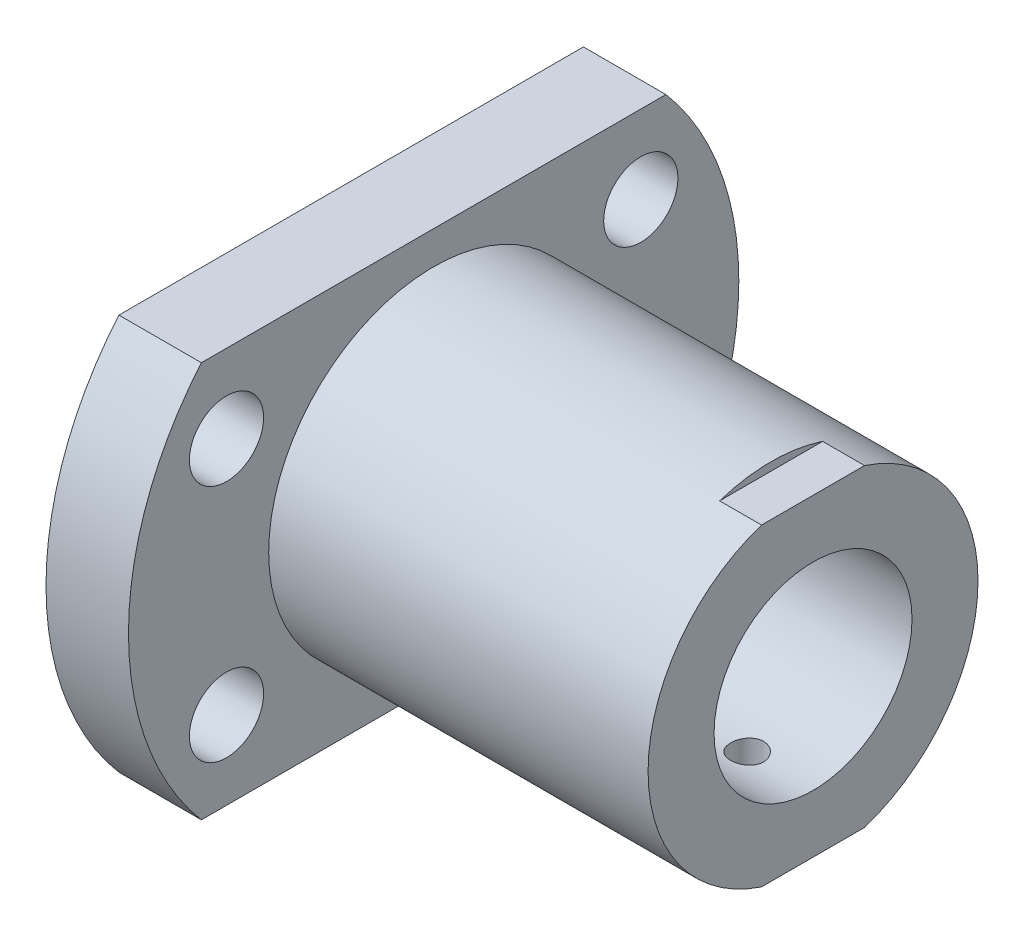
ISO-10303-21;
HEADER;
FILE_DESCRIPTION(('STEP AP214'),'2;1');
FILE_NAME('part.step','',(''),(''),'','','');
FILE_SCHEMA(('AUTOMOTIVE_DESIGN { 1 0 10303 214 1 1 1 1 }'));
ENDSEC;
DATA;
#1=APPLICATION_CONTEXT('core data for automotive mechanical design processes');
#2=APPLICATION_PROTOCOL_DEFINITION('international standard','automotive_design',2000,#1);
#3=PRODUCT_CONTEXT('',#1,'mechanical');
#4=PRODUCT('Part','Part','',(#3));
#5=PRODUCT_RELATED_PRODUCT_CATEGORY('part','',(#4));
#6=PRODUCT_DEFINITION_FORMATION('','',#4);
#7=PRODUCT_DEFINITION_CONTEXT('part definition',#1,'design');
#8=PRODUCT_DEFINITION('design','',#6,#7);
#9=PRODUCT_DEFINITION_SHAPE('','',#8);
#10=(LENGTH_UNIT() NAMED_UNIT(*) SI_UNIT(.MILLI.,.METRE.));
#11=(NAMED_UNIT(*) PLANE_ANGLE_UNIT() SI_UNIT($,.RADIAN.));
#12=(NAMED_UNIT(*) SI_UNIT($,.STERADIAN.) SOLID_ANGLE_UNIT());
#13=UNCERTAINTY_MEASURE_WITH_UNIT(LENGTH_MEASURE(1.E-05),#10,'distance_accuracy_value','');
#14=(GEOMETRIC_REPRESENTATION_CONTEXT(3) GLOBAL_UNCERTAINTY_ASSIGNED_CONTEXT((#13)) GLOBAL_UNIT_ASSIGNED_CONTEXT((#10,
#11,#12)) REPRESENTATION_CONTEXT('',''));
#15=CARTESIAN_POINT('',(0.,0.,0.));
#16=DIRECTION('',(0.,0.,1.));
#17=DIRECTION('',(1.,0.,0.));
#18=AXIS2_PLACEMENT_3D('',#15,#16,#17);
#19=CARTESIAN_POINT('',(0.,0.,0.));
#20=DIRECTION('',(1.,0.,0.));
#21=DIRECTION('',(0.,0.,-0.999999999999998));
#22=AXIS2_PLACEMENT_3D('',#19,#20,#21);
#23=PLANE('',#22);
#24=DIRECTION('',(0.,0.,-0.999999999999998));
#25=VECTOR('',#24,1.);
#26=CARTESIAN_POINT('',(0.,-12.,-14.0801278403287));
#27=LINE('',#26,#25);
#28=CARTESIAN_POINT('',(0.,-12.,14.0801278403287));
#29=VERTEX_POINT('',#28);
#30=CARTESIAN_POINT('',(0.,-12.,-14.0801278403287));
#31=VERTEX_POINT('',#30);
#32=EDGE_CURVE('E98',#29,#31,#27,.T.);
#33=ORIENTED_EDGE('',*,*,#32,.F.);
#34=CARTESIAN_POINT('',(0.,0.,0.));
#35=DIRECTION('',(-1.,0.,0.));
#36=DIRECTION('',(0.,0.,0.999999999999998));
#37=AXIS2_PLACEMENT_3D('',#34,#35,#36);
#38=CIRCLE('',#37,18.5);
#39=CARTESIAN_POINT('',(0.,12.,14.0801278403287));
#40=VERTEX_POINT('',#39);
#41=EDGE_CURVE('E85',#40,#29,#38,.F.);
#42=ORIENTED_EDGE('',*,*,#41,.F.);
#43=DIRECTION('',(0.,0.,0.999999999999998));
#44=VECTOR('',#43,1.);
#45=CARTESIAN_POINT('',(0.,12.,-14.0801278403287));
#46=LINE('',#45,#44);
#47=CARTESIAN_POINT('',(0.,12.,-14.0801278403287));
#48=VERTEX_POINT('',#47);
#49=EDGE_CURVE('E95',#48,#40,#46,.T.);
#50=ORIENTED_EDGE('',*,*,#49,.F.);
#51=CARTESIAN_POINT('',(0.,0.,0.));
#52=DIRECTION('',(-1.,0.,0.));
#53=DIRECTION('',(0.,0.,0.999999999999998));
#54=AXIS2_PLACEMENT_3D('',#51,#52,#53);
#55=CIRCLE('',#54,18.5);
#56=EDGE_CURVE('E101',#31,#48,#55,.F.);
#57=ORIENTED_EDGE('',*,*,#56,.F.);
#58=EDGE_LOOP('',(#33,#42,#50,#57));
#59=FACE_BOUND('',#58,.T.);
#60=CARTESIAN_POINT('',(0.,0.,0.));
#61=DIRECTION('',(-1.,0.,0.));
#62=DIRECTION('',(0.,0.,0.999999999999998));
#63=AXIS2_PLACEMENT_3D('',#60,#61,#62);
#64=CIRCLE('',#63,6.);
#65=CARTESIAN_POINT('',(0.,0.,5.99999999999999));
#66=VERTEX_POINT('',#65);
#67=EDGE_CURVE('E177',#66,#66,#64,.F.);
#68=ORIENTED_EDGE('',*,*,#67,.T.);
#69=EDGE_LOOP('',(#68));
#70=FACE_BOUND('',#69,.T.);
#71=CARTESIAN_POINT('',(0.,7.25,-12.5573683548743));
#72=DIRECTION('',(-1.,0.,0.));
#73=DIRECTION('',(0.,0.,0.999999999999998));
#74=AXIS2_PLACEMENT_3D('',#71,#72,#73);
#75=CIRCLE('',#74,2.25);
#76=CARTESIAN_POINT('',(0.,7.25,-10.3073683548743));
#77=VERTEX_POINT('',#76);
#78=EDGE_CURVE('E104',#77,#77,#75,.F.);
#79=ORIENTED_EDGE('',*,*,#78,.T.);
#80=EDGE_LOOP('',(#79));
#81=FACE_BOUND('',#80,.T.);
#82=CARTESIAN_POINT('',(0.,-7.25,-12.5573683548743));
#83=DIRECTION('',(-1.,0.,0.));
#84=DIRECTION('',(0.,0.,0.999999999999998));
#85=AXIS2_PLACEMENT_3D('',#82,#83,#84);
#86=CIRCLE('',#85,2.25);
#87=CARTESIAN_POINT('',(0.,-7.25,-10.3073683548743));
#88=VERTEX_POINT('',#87);
#89=EDGE_CURVE('E184',#88,#88,#86,.F.);
#90=ORIENTED_EDGE('',*,*,#89,.T.);
#91=EDGE_LOOP('',(#90));
#92=FACE_BOUND('',#91,.T.);
#93=CARTESIAN_POINT('',(0.,-7.25000000000001,12.5573683548743));
#94=DIRECTION('',(-1.,0.,0.));
#95=DIRECTION('',(0.,0.,0.999999999999998));
#96=AXIS2_PLACEMENT_3D('',#93,#94,#95);
#97=CIRCLE('',#96,2.25);
#98=CARTESIAN_POINT('',(0.,-7.25000000000001,14.8073683548743));
#99=VERTEX_POINT('',#98);
#100=EDGE_CURVE('E186',#99,#99,#97,.F.);
#101=ORIENTED_EDGE('',*,*,#100,.T.);
#102=EDGE_LOOP('',(#101));
#103=FACE_BOUND('',#102,.T.);
#104=CARTESIAN_POINT('',(0.,7.25000000000001,12.5573683548743));
#105=DIRECTION('',(-1.,0.,0.));
#106=DIRECTION('',(0.,0.,0.999999999999998));
#107=AXIS2_PLACEMENT_3D('',#104,#105,#106);
#108=CIRCLE('',#107,2.25);
#109=CARTESIAN_POINT('',(0.,7.25000000000001,14.8073683548743));
#110=VERTEX_POINT('',#109);
#111=EDGE_CURVE('E27',#110,#110,#108,.F.);
#112=ORIENTED_EDGE('',*,*,#111,.T.);
#113=EDGE_LOOP('',(#112));
#114=FACE_BOUND('',#113,.T.);
#115=ADVANCED_FACE('F24',(#59,#70,#81,#92,#103,#114),#23,.F.);
#116=CARTESIAN_POINT('',(28.,7.25000000000001,12.5573683548743));
#117=DIRECTION('',(-1.,0.,0.));
#118=DIRECTION('',(0.,0.,0.999999999999998));
#119=AXIS2_PLACEMENT_3D('',#116,#117,#118);
#120=CYLINDRICAL_SURFACE('',#119,2.25);
#121=CARTESIAN_POINT('',(5.00000000000012,7.25,12.5573683548744));
#122=DIRECTION('',(-1.,0.,0.));
#123=DIRECTION('',(0.,0.,0.999999999999998));
#124=AXIS2_PLACEMENT_3D('',#121,#122,#123);
#125=CIRCLE('',#124,2.25);
#126=CARTESIAN_POINT('',(5.00000000000012,7.25,14.8073683548744));
#127=VERTEX_POINT('',#126);
#128=EDGE_CURVE('E412',#127,#127,#125,.F.);
#129=ORIENTED_EDGE('',*,*,#128,.T.);
#130=EDGE_LOOP('',(#129));
#131=FACE_BOUND('',#130,.T.);
#132=ORIENTED_EDGE('',*,*,#111,.F.);
#133=EDGE_LOOP('',(#132));
#134=FACE_BOUND('',#133,.T.);
#135=ADVANCED_FACE('F194',(#131,#134),#120,.F.);
#136=CARTESIAN_POINT('',(28.,-7.25000000000001,12.5573683548743));
#137=DIRECTION('',(-1.,0.,0.));
#138=DIRECTION('',(0.,0.,0.999999999999998));
#139=AXIS2_PLACEMENT_3D('',#136,#137,#138);
#140=CYLINDRICAL_SURFACE('',#139,2.25);
#141=CARTESIAN_POINT('',(5.00000000000012,-7.25000000000001,12.5573683548743));
#142=DIRECTION('',(-1.,0.,0.));
#143=DIRECTION('',(0.,0.,0.999999999999998));
#144=AXIS2_PLACEMENT_3D('',#141,#142,#143);
#145=CIRCLE('',#144,2.25);
#146=CARTESIAN_POINT('',(5.00000000000012,-7.25000000000001,14.8073683548743));
#147=VERTEX_POINT('',#146);
#148=EDGE_CURVE('E408',#147,#147,#145,.F.);
#149=ORIENTED_EDGE('',*,*,#148,.T.);
#150=EDGE_LOOP('',(#149));
#151=FACE_BOUND('',#150,.T.);
#152=ORIENTED_EDGE('',*,*,#100,.F.);
#153=EDGE_LOOP('',(#152));
#154=FACE_BOUND('',#153,.T.);
#155=ADVANCED_FACE('F196',(#151,#154),#140,.F.);
#156=CARTESIAN_POINT('',(28.,-7.25,-12.5573683548743));
#157=DIRECTION('',(-1.,0.,0.));
#158=DIRECTION('',(0.,0.,0.999999999999998));
#159=AXIS2_PLACEMENT_3D('',#156,#157,#158);
#160=CYLINDRICAL_SURFACE('',#159,2.25);
#161=CARTESIAN_POINT('',(4.99999999999989,-7.25,-12.5573683548743));
#162=DIRECTION('',(-1.,0.,0.));
#163=DIRECTION('',(0.,0.,0.999999999999998));
#164=AXIS2_PLACEMENT_3D('',#161,#162,#163);
#165=CIRCLE('',#164,2.25);
#166=CARTESIAN_POINT('',(4.99999999999989,-7.25,-10.3073683548743));
#167=VERTEX_POINT('',#166);
#168=EDGE_CURVE('E266',#167,#167,#165,.F.);
#169=ORIENTED_EDGE('',*,*,#168,.T.);
#170=EDGE_LOOP('',(#169));
#171=FACE_BOUND('',#170,.T.);
#172=ORIENTED_EDGE('',*,*,#89,.F.);
#173=EDGE_LOOP('',(#172));
#174=FACE_BOUND('',#173,.T.);
#175=ADVANCED_FACE('F204',(#171,#174),#160,.F.);
#176=CARTESIAN_POINT('',(28.,7.25,-12.5573683548743));
#177=DIRECTION('',(-1.,0.,0.));
#178=DIRECTION('',(0.,0.,0.999999999999998));
#179=AXIS2_PLACEMENT_3D('',#176,#177,#178);
#180=CYLINDRICAL_SURFACE('',#179,2.25);
#181=CARTESIAN_POINT('',(4.99999999999989,7.24999999999999,-12.5573683548743));
#182=DIRECTION('',(-1.,0.,0.));
#183=DIRECTION('',(0.,0.,0.999999999999998));
#184=AXIS2_PLACEMENT_3D('',#181,#182,#183);
#185=CIRCLE('',#184,2.25);
#186=CARTESIAN_POINT('',(4.99999999999989,7.24999999999999,-10.3073683548743));
#187=VERTEX_POINT('',#186);
#188=EDGE_CURVE('E263',#187,#187,#185,.F.);
#189=ORIENTED_EDGE('',*,*,#188,.T.);
#190=EDGE_LOOP('',(#189));
#191=FACE_BOUND('',#190,.T.);
#192=ORIENTED_EDGE('',*,*,#78,.F.);
#193=EDGE_LOOP('',(#192));
#194=FACE_BOUND('',#193,.T.);
#195=ADVANCED_FACE('F212',(#191,#194),#180,.F.);
#196=CARTESIAN_POINT('',(4.99999999999989,-12.,-14.0801278403287));
#197=DIRECTION('',(0.,-0.999999999999998,0.));
#198=DIRECTION('',(0.,0.,-0.999999999999998));
#199=AXIS2_PLACEMENT_3D('',#196,#197,#198);
#200=PLANE('',#199);
#201=DIRECTION('',(0.,0.,0.999999999999998));
#202=VECTOR('',#201,1.);
#203=CARTESIAN_POINT('',(5.00000000000012,-12.,0.));
#204=LINE('',#203,#202);
#205=CARTESIAN_POINT('',(4.99999999999989,-12.,-14.0801278403287));
#206=VERTEX_POINT('',#205);
#207=CARTESIAN_POINT('',(5.00000000000012,-12.,14.0801278403287));
#208=VERTEX_POINT('',#207);
#209=EDGE_CURVE('E109',#206,#208,#204,.T.);
#210=ORIENTED_EDGE('',*,*,#209,.T.);
#211=DIRECTION('',(-1.,0.,0.));
#212=VECTOR('',#211,1.);
#213=CARTESIAN_POINT('',(5.00000000000012,-12.,14.0801278403287));
#214=LINE('',#213,#212);
#215=EDGE_CURVE('E91',#29,#208,#214,.F.);
#216=ORIENTED_EDGE('',*,*,#215,.F.);
#217=ORIENTED_EDGE('',*,*,#32,.T.);
#218=DIRECTION('',(-1.,0.,0.));
#219=VECTOR('',#218,1.);
#220=CARTESIAN_POINT('',(4.99999999999989,-12.,-14.0801278403287));
#221=LINE('',#220,#219);
#222=EDGE_CURVE('E256',#206,#31,#221,.T.);
#223=ORIENTED_EDGE('',*,*,#222,.F.);
#224=EDGE_LOOP('',(#210,#216,#217,#223));
#225=FACE_BOUND('',#224,.T.);
#226=ADVANCED_FACE('F107',(#225),#200,.T.);
#227=CARTESIAN_POINT('',(5.00000000000012,0.,0.));
#228=DIRECTION('',(-1.,0.,0.));
#229=DIRECTION('',(0.,0.,0.999999999999998));
#230=AXIS2_PLACEMENT_3D('',#227,#228,#229);
#231=CYLINDRICAL_SURFACE('',#230,18.5);
#232=DIRECTION('',(1.,0.,0.));
#233=VECTOR('',#232,1.);
#234=CARTESIAN_POINT('',(5.00000000000012,12.,14.0801278403287));
#235=LINE('',#234,#233);
#236=CARTESIAN_POINT('',(5.00000000000012,12.,14.0801278403287));
#237=VERTEX_POINT('',#236);
#238=EDGE_CURVE('E93',#40,#237,#235,.T.);
#239=ORIENTED_EDGE('',*,*,#238,.F.);
#240=ORIENTED_EDGE('',*,*,#41,.T.);
#241=ORIENTED_EDGE('',*,*,#215,.T.);
#242=CARTESIAN_POINT('',(5.00000000000012,0.,0.));
#243=DIRECTION('',(-1.,0.,0.));
#244=DIRECTION('',(0.,0.,0.999999999999998));
#245=AXIS2_PLACEMENT_3D('',#242,#243,#244);
#246=CIRCLE('',#245,18.5);
#247=EDGE_CURVE('E262',#208,#237,#246,.T.);
#248=ORIENTED_EDGE('',*,*,#247,.T.);
#249=EDGE_LOOP('',(#239,#240,#241,#248));
#250=FACE_BOUND('',#249,.T.);
#251=ADVANCED_FACE('F89',(#250),#231,.T.);
#252=CARTESIAN_POINT('',(4.99999999999989,12.,-14.0801278403287));
#253=DIRECTION('',(0.,0.999999999999998,0.));
#254=DIRECTION('',(0.,0.,0.999999999999998));
#255=AXIS2_PLACEMENT_3D('',#252,#253,#254);
#256=PLANE('',#255);
#257=DIRECTION('',(0.,0.,0.999999999999998));
#258=VECTOR('',#257,1.);
#259=CARTESIAN_POINT('',(5.00000000000012,12.,0.));
#260=LINE('',#259,#258);
#261=CARTESIAN_POINT('',(4.99999999999989,12.,-14.0801278403287));
#262=VERTEX_POINT('',#261);
#263=EDGE_CURVE('E251',#237,#262,#260,.F.);
#264=ORIENTED_EDGE('',*,*,#263,.T.);
#265=DIRECTION('',(-1.,0.,0.));
#266=VECTOR('',#265,1.);
#267=CARTESIAN_POINT('',(4.99999999999989,12.,-14.0801278403287));
#268=LINE('',#267,#266);
#269=EDGE_CURVE('E180',#48,#262,#268,.F.);
#270=ORIENTED_EDGE('',*,*,#269,.F.);
#271=ORIENTED_EDGE('',*,*,#49,.T.);
#272=ORIENTED_EDGE('',*,*,#238,.T.);
#273=EDGE_LOOP('',(#264,#270,#271,#272));
#274=FACE_BOUND('',#273,.T.);
#275=ADVANCED_FACE('F221',(#274),#256,.T.);
#276=CARTESIAN_POINT('',(5.00000000000012,0.,0.));
#277=DIRECTION('',(-1.,0.,0.));
#278=DIRECTION('',(0.,0.,0.999999999999998));
#279=AXIS2_PLACEMENT_3D('',#276,#277,#278);
#280=CYLINDRICAL_SURFACE('',#279,18.5);
#281=CARTESIAN_POINT('',(5.00000000000012,0.,0.));
#282=DIRECTION('',(-1.,0.,0.));
#283=DIRECTION('',(0.,0.,0.999999999999998));
#284=AXIS2_PLACEMENT_3D('',#281,#282,#283);
#285=CIRCLE('',#284,18.5);
#286=EDGE_CURVE('E248',#262,#206,#285,.T.);
#287=ORIENTED_EDGE('',*,*,#286,.T.);
#288=ORIENTED_EDGE('',*,*,#222,.T.);
#289=ORIENTED_EDGE('',*,*,#56,.T.);
#290=ORIENTED_EDGE('',*,*,#269,.T.);
#291=EDGE_LOOP('',(#287,#288,#289,#290));
#292=FACE_BOUND('',#291,.T.);
#293=ADVANCED_FACE('F224',(#292),#280,.T.);
#294=CARTESIAN_POINT('',(25.46,-9.49999999999995,-18.4999999999999));
#295=DIRECTION('',(-1.,0.,0.));
#296=DIRECTION('',(0.,-0.999999999999998,0.));
#297=AXIS2_PLACEMENT_3D('',#294,#295,#296);
#298=PLANE('',#297);
#299=CARTESIAN_POINT('',(25.46,0.,0.));
#300=DIRECTION('',(-1.,0.,0.));
#301=DIRECTION('',(0.,0.,0.999999999999998));
#302=AXIS2_PLACEMENT_3D('',#299,#300,#301);
#303=CIRCLE('',#302,10.);
#304=CARTESIAN_POINT('',(25.46,-9.49999999999995,-3.12249899919919));
#305=VERTEX_POINT('',#304);
#306=CARTESIAN_POINT('',(25.46,-9.49999999999995,3.1224989991992));
#307=VERTEX_POINT('',#306);
#308=EDGE_CURVE('E139',#305,#307,#303,.T.);
#309=ORIENTED_EDGE('',*,*,#308,.F.);
#310=DIRECTION('',(0.,0.,0.999999999999998));
#311=VECTOR('',#310,1.);
#312=CARTESIAN_POINT('',(25.46,-9.49999999999995,-18.4999999999999));
#313=LINE('',#312,#311);
#314=EDGE_CURVE('E178',#305,#307,#313,.T.);
#315=ORIENTED_EDGE('',*,*,#314,.T.);
#316=EDGE_LOOP('',(#309,#315));
#317=FACE_BOUND('',#316,.T.);
#318=ADVANCED_FACE('F227',(#317),#298,.F.);
#319=CARTESIAN_POINT('',(24.,-12.,0.));
#320=DIRECTION('',(0.,0.999999999999998,0.));
#321=DIRECTION('',(0.,0.,0.999999999999998));
#322=AXIS2_PLACEMENT_3D('',#319,#320,#321);
#323=CYLINDRICAL_SURFACE('',#322,0.999999999999998);
#324=CARTESIAN_POINT('',(24.,-5.9160797830996,0.999999999999998));
#325=CARTESIAN_POINT('',(24.0556957397448,-5.91608089760081,0.999997430362741));
#326=CARTESIAN_POINT('',(24.1114625857719,-5.91687549623226,0.995327225125161));
#327=CARTESIAN_POINT('',(24.221473367225,-5.91996725428782,0.976766506224323));
#328=CARTESIAN_POINT('',(24.2757139738487,-5.92226746704963,0.962857255219484));
#329=CARTESIAN_POINT('',(24.3810020750205,-5.9281028210368,0.926249422813524));
#330=CARTESIAN_POINT('',(24.4320535063324,-5.93163640278116,0.903561936766058));
#331=CARTESIAN_POINT('',(24.5296048620221,-5.93953821561519,0.850066639095283));
#332=CARTESIAN_POINT('',(24.5761064650154,-5.94390613711394,0.819261837886826));
#333=CARTESIAN_POINT('',(24.6637238714249,-5.95303376602086,0.750075912978837));
#334=CARTESIAN_POINT('',(24.7047878920607,-5.95779662271406,0.711629612614978));
#335=CARTESIAN_POINT('',(24.7799155928021,-5.96714968490889,0.628391119356976));
#336=CARTESIAN_POINT('',(24.8139784963782,-5.97173987121269,0.583598223459339));
#337=CARTESIAN_POINT('',(24.8743259504081,-5.98026296666788,0.488608939901644));
#338=CARTESIAN_POINT('',(24.9005630285583,-5.98419180380442,0.438381996060007));
#339=CARTESIAN_POINT('',(24.9442085816065,-5.99091497211554,0.334157780528439));
#340=CARTESIAN_POINT('',(24.9616177068691,-5.99370938686121,0.280160786915636));
#341=CARTESIAN_POINT('',(24.9869570028592,-5.99782693717047,0.17045753626894));
#342=CARTESIAN_POINT('',(24.9949731532148,-5.99916341023759,0.114771647626942));
#343=CARTESIAN_POINT('',(25.0015663038604,-6.00026031774893,0.00283020778882557));
#344=CARTESIAN_POINT('',(25.0001439300671,-6.00002085670141,-0.0534253053855496));
#345=CARTESIAN_POINT('',(24.9879674852323,-5.99800343784228,-0.164320648453429));
#346=CARTESIAN_POINT('',(24.9773060259492,-5.99624074921798,-0.218970964751025));
#347=CARTESIAN_POINT('',(24.9470997266195,-5.99139194038926,-0.325696364455009));
#348=CARTESIAN_POINT('',(24.9275545434525,-5.98830576906757,-0.377771348306917));
#349=CARTESIAN_POINT('',(24.8800428392955,-5.9811306549925,-0.478144400660144));
#350=CARTESIAN_POINT('',(24.8520378864421,-5.97703715210987,-0.526423938030269));
#351=CARTESIAN_POINT('',(24.7884320570964,-5.96830259348044,-0.617629541642183));
#352=CARTESIAN_POINT('',(24.7528311514854,-5.96366153563462,-0.660555587360568));
#353=CARTESIAN_POINT('',(24.6745373682106,-5.95428211061504,-0.740379653882549));
#354=CARTESIAN_POINT('',(24.6317648343995,-5.94954324332981,-0.777199520036914));
#355=CARTESIAN_POINT('',(24.5405857257886,-5.9405537217856,-0.843169007131577));
#356=CARTESIAN_POINT('',(24.4921766297696,-5.9363032877035,-0.872315176491826));
#357=CARTESIAN_POINT('',(24.3909947392698,-5.92877116046281,-0.922122995219518));
#358=CARTESIAN_POINT('',(24.3382137479272,-5.92549134225202,-0.942768253004008));
#359=CARTESIAN_POINT('',(24.2299355600205,-5.92030089070035,-0.974836086298908));
#360=CARTESIAN_POINT('',(24.1744443666017,-5.91838736593833,-0.986278144632032));
#361=CARTESIAN_POINT('',(24.0987926780436,-5.91687159118962,-0.995305748985427));
#362=CARTESIAN_POINT('',(24.0790789007516,-5.91657531838754,-0.997064672925258));
#363=CARTESIAN_POINT('',(24.0395797428413,-5.91617921619692,-0.999412255641836));
#364=CARTESIAN_POINT('',(24.0197943621517,-5.91607938700396,-1.00000091325352));
#365=CARTESIAN_POINT('',(23.9443042602552,-5.91608089760082,-0.999997430362724));
#366=CARTESIAN_POINT('',(23.888537414228,-5.91687549623227,-0.995327225125135));
#367=CARTESIAN_POINT('',(23.7785266327749,-5.91996725428782,-0.976766506224316));
#368=CARTESIAN_POINT('',(23.7242860261512,-5.92226746704962,-0.962857255219505));
#369=CARTESIAN_POINT('',(23.6189979249794,-5.9281028210368,-0.926249422813522));
#370=CARTESIAN_POINT('',(23.5679464936675,-5.93163640278117,-0.903561936766016));
#371=CARTESIAN_POINT('',(23.4703951379778,-5.93953821561521,-0.85006663909523));
#372=CARTESIAN_POINT('',(23.4238935349846,-5.94390613711396,-0.819261837886801));
#373=CARTESIAN_POINT('',(23.3362761285751,-5.95303376602087,-0.750075912978841));
#374=CARTESIAN_POINT('',(23.2952121079394,-5.95779662271406,-0.71162961261498));
#375=CARTESIAN_POINT('',(23.220084407198,-5.96714968490889,-0.628391119356981));
#376=CARTESIAN_POINT('',(23.1860215036219,-5.9717398712127,-0.583598223459348));
#377=CARTESIAN_POINT('',(23.125674049592,-5.98026296666789,-0.48860893990163));
#378=CARTESIAN_POINT('',(23.0994369714418,-5.98419180380442,-0.438381996059965));
#379=CARTESIAN_POINT('',(23.0557914183935,-5.99091497211554,-0.334157780528404));
#380=CARTESIAN_POINT('',(23.0383822931307,-5.99370938686122,-0.280160786915637));
#381=CARTESIAN_POINT('',(23.0130429971406,-5.99782693717048,-0.170457536268957));
#382=CARTESIAN_POINT('',(23.0050268467852,-5.99916341023759,-0.114771647626942));
#383=CARTESIAN_POINT('',(22.9984336961397,-6.00026031774893,-0.00283020778881479));
#384=CARTESIAN_POINT('',(22.999856069933,-6.00002085670142,0.053425305385553));
#385=CARTESIAN_POINT('',(23.0120325147677,-5.99800343784229,0.16432064845343));
#386=CARTESIAN_POINT('',(23.0226939740508,-5.99624074921798,0.218970964751031));
#387=CARTESIAN_POINT('',(23.0529002733805,-5.99139194038926,0.325696364455016));
#388=CARTESIAN_POINT('',(23.0724454565476,-5.98830576906757,0.377771348306921));
#389=CARTESIAN_POINT('',(23.1199571607045,-5.9811306549925,0.478144400660142));
#390=CARTESIAN_POINT('',(23.147962113558,-5.97703715210987,0.526423938030264));
#391=CARTESIAN_POINT('',(23.2115679429037,-5.96830259348044,0.617629541642179));
#392=CARTESIAN_POINT('',(23.2471688485147,-5.96366153563462,0.660555587360567));
#393=CARTESIAN_POINT('',(23.3254626317895,-5.95428211061504,0.74037965388255));
#394=CARTESIAN_POINT('',(23.3682351656005,-5.9495432433298,0.777199520036914));
#395=CARTESIAN_POINT('',(23.4594142742115,-5.9405537217856,0.843169007131579));
#396=CARTESIAN_POINT('',(23.5078233702305,-5.93630328770352,0.872315176491831));
#397=CARTESIAN_POINT('',(23.6090052607303,-5.92877116046282,0.92212299521952));
#398=CARTESIAN_POINT('',(23.6617862520729,-5.92549134225202,0.942768253004003));
#399=CARTESIAN_POINT('',(23.7700644399796,-5.92030089070036,0.974836086298911));
#400=CARTESIAN_POINT('',(23.8255556333984,-5.91838736593835,0.986278144632048));
#401=CARTESIAN_POINT('',(23.9012073219564,-5.91687159118963,0.995305748985431));
#402=CARTESIAN_POINT('',(23.9209210992484,-5.91657531838754,0.997064672925256));
#403=CARTESIAN_POINT('',(23.9604202571587,-5.91617921619692,0.999412255641834));
#404=CARTESIAN_POINT('',(23.9802056378483,-5.91607938700395,1.00000091325352));
#405=CARTESIAN_POINT('',(24.,-5.9160797830996,0.999999999999998));
#406=B_SPLINE_CURVE_WITH_KNOTS('',3,(#324,#325,#326,#327,#328,#329,#330,#331,#332,#333,#334,
#335,#336,#337,#338,#339,#340,#341,#342,#343,#344,#345,#346,#347,#348,#349,#350,#351,#352,#353,
#354,#355,#356,#357,#358,#359,#360,#361,#362,#363,#364,#365,#366,#367,#368,#369,#370,#371,#372,
#373,#374,#375,#376,#377,#378,#379,#380,#381,#382,#383,#384,#385,#386,#387,#388,#389,#390,#391,
#392,#393,#394,#395,#396,#397,#398,#399,#400,#401,#402,#403,#404,#405),.UNSPECIFIED.,.T.,.F.,(4,
2,2,2,2,2,2,2,2,2,2,2,2,2,2,2,2,2,2,2,2,2,2,2,2,2,2,2,2,2,2,2,2,2,2,2,2,2,2,2,4),(0.,
0.167011630447641,0.334363008938152,0.501503549060827,0.668582189907082,0.837152287302664,
1.00574107159061,1.17533265406034,1.34491174072129,1.51292613069493,1.68092937888662,
1.84726780553134,2.01361265729292,2.18072486086636,2.34783770506953,2.51694730622918,
2.68613284236411,2.85564309389003,3.02479354716648,3.08414971014379,3.14350593221349,
3.31051756266124,3.47786894115186,3.64500948127443,3.81208812212059,3.98065821951616,
4.14924700380411,4.31883858627389,4.48841767293486,4.65643206290847,4.82443531110016,
4.99077373774489,5.15711858950646,5.3242307930799,5.49134363728307,5.66045323844273,
5.82963877457765,5.99914902610357,6.16829947938002,6.22765564235733,6.28701186442703),.UNSPECIFIED.);
#407=CARTESIAN_POINT('',(24.,-5.9160797830996,0.999999999999998));
#408=VERTEX_POINT('',#407);
#409=EDGE_CURVE('E171',#408,#408,#406,.T.);
#410=ORIENTED_EDGE('',*,*,#409,.T.);
#411=EDGE_LOOP('',(#410));
#412=FACE_BOUND('',#411,.T.);
#413=CARTESIAN_POINT('',(24.0000000000002,-9.94987437106615,-0.99999999999999));
#414=CARTESIAN_POINT('',(23.9440143824036,-9.94987541116598,-0.999995487044231));
#415=CARTESIAN_POINT('',(23.8879816523879,-9.95035218509344,-0.995281068962157));
#416=CARTESIAN_POINT('',(23.7774178898695,-9.95220939516237,-0.976530932220191));
#417=CARTESIAN_POINT('',(23.7228902648581,-9.95359173043274,-0.962475623092606));
#418=CARTESIAN_POINT('',(23.6170282681463,-9.95710156588803,-0.925457761180721));
#419=CARTESIAN_POINT('',(23.5656908001442,-9.95922832981091,-0.902504006819668));
#420=CARTESIAN_POINT('',(23.467620980052,-9.96398642377636,-0.848356891592326));
#421=CARTESIAN_POINT('',(23.4208866318967,-9.9666175336466,-0.817167123924173));
#422=CARTESIAN_POINT('',(23.3331498477304,-9.97209920165956,-0.747305611206813));
#423=CARTESIAN_POINT('',(23.2921670052552,-9.97495046098913,-0.708609311434772));
#424=CARTESIAN_POINT('',(23.217264042001,-9.98054491761494,-0.624883919580109));
#425=CARTESIAN_POINT('',(23.1833445891061,-9.98328810467246,-0.579854229312722));
#426=CARTESIAN_POINT('',(23.1234686128998,-9.98836384290782,-0.484626150976358));
#427=CARTESIAN_POINT('',(23.0975287744923,-9.99069552938328,-0.434417222039392));
#428=CARTESIAN_POINT('',(23.0544554162662,-9.99467818320867,-0.330329513034766));
#429=CARTESIAN_POINT('',(23.0373216049424,-9.99632917309129,-0.276450854512707));
#430=CARTESIAN_POINT('',(23.0124021018675,-9.99875966462898,-0.166744831538019));
#431=CARTESIAN_POINT('',(23.004585180925,-9.99954207705162,-0.110924626245308));
#432=CARTESIAN_POINT('',(22.9984247281265,-10.0001571562716,0.00124064081207691));
#433=CARTESIAN_POINT('',(23.000080967399,-9.99998984601417,0.0575856898636996));
#434=CARTESIAN_POINT('',(23.0127944430196,-9.99872671597688,0.168988591051381));
#435=CARTESIAN_POINT('',(23.0238180123982,-9.99763422143477,0.22405032828898));
#436=CARTESIAN_POINT('',(23.0549009483937,-9.99464730999638,0.331538700026723));
#437=CARTESIAN_POINT('',(23.0749605145647,-9.99275287538983,0.383965276302605));
#438=CARTESIAN_POINT('',(23.1235837600771,-9.98836928375461,0.484802402633358));
#439=CARTESIAN_POINT('',(23.1521626272465,-9.98587906616926,0.533205581195191));
#440=CARTESIAN_POINT('',(23.216999568827,-9.98058361365591,0.624537074702192));
#441=CARTESIAN_POINT('',(23.2532572340215,-9.97777839551859,0.667465681201588));
#442=CARTESIAN_POINT('',(23.3326049022721,-9.97215358179339,0.746823595506791));
#443=CARTESIAN_POINT('',(23.3757228706156,-9.96933397517685,0.783224944555337));
#444=CARTESIAN_POINT('',(23.4674948721236,-9.9640085742925,0.848294227667574));
#445=CARTESIAN_POINT('',(23.5161514573557,-9.9615029258156,0.876958576023986));
#446=CARTESIAN_POINT('',(23.6176584994678,-9.95708852009588,0.925737964186998));
#447=CARTESIAN_POINT('',(23.6705132317065,-9.95518038138155,0.94584415246408));
#448=CARTESIAN_POINT('',(23.7787850994922,-9.95218690590293,0.976843473662411));
#449=CARTESIAN_POINT('',(23.8341965331201,-9.95109982399908,0.987756152934959));
#450=CARTESIAN_POINT('',(23.9265821166601,-9.95007764862543,0.997979904737813));
#451=CARTESIAN_POINT('',(23.9632809253796,-9.94987368889983,1.00000295989518));
#452=CARTESIAN_POINT('',(24.0559856175966,-9.94987541116598,0.99999548704422));
#453=CARTESIAN_POINT('',(24.1120183476124,-9.95035218509344,0.995281068962128));
#454=CARTESIAN_POINT('',(24.2225821101308,-9.95220939516237,0.97653093222014));
#455=CARTESIAN_POINT('',(24.2771097351422,-9.95359173043274,0.962475623092552));
#456=CARTESIAN_POINT('',(24.3829717318539,-9.95710156588803,0.925457761180664));
#457=CARTESIAN_POINT('',(24.434309199856,-9.95922832981091,0.902504006819616));
#458=CARTESIAN_POINT('',(24.5323790199481,-9.96398642377638,0.848356891592234));
#459=CARTESIAN_POINT('',(24.5791133681034,-9.96661753364664,0.817167123924038));
#460=CARTESIAN_POINT('',(24.6668501522697,-9.97209920165959,0.747305611206688));
#461=CARTESIAN_POINT('',(24.7078329947449,-9.97495046098914,0.708609311434696));
#462=CARTESIAN_POINT('',(24.7827359579991,-9.98054491761494,0.624883919580024));
#463=CARTESIAN_POINT('',(24.816655410894,-9.98328810467246,0.579854229312581));
#464=CARTESIAN_POINT('',(24.8765313871003,-9.98836384290783,0.484626150976187));
#465=CARTESIAN_POINT('',(24.9024712255078,-9.99069552938328,0.434417222039247));
#466=CARTESIAN_POINT('',(24.9455445837339,-9.99467818320868,0.330329513034622));
#467=CARTESIAN_POINT('',(24.9626783950576,-9.99632917309131,0.276450854512539));
#468=CARTESIAN_POINT('',(24.9875978981326,-9.998759664629,0.166744831537832));
#469=CARTESIAN_POINT('',(24.995414819075,-9.99954207705163,0.110924626245127));
#470=CARTESIAN_POINT('',(25.0015752718736,-10.0001571562716,-0.00124064081225615));
#471=CARTESIAN_POINT('',(24.999919032601,-9.99998984601415,-0.0575856898638841));
#472=CARTESIAN_POINT('',(24.9872055569805,-9.99872671597685,-0.168988591051559));
#473=CARTESIAN_POINT('',(24.9761819876018,-9.99763422143475,-0.224050328289148));
#474=CARTESIAN_POINT('',(24.9450990516063,-9.99464730999638,-0.331538700026889));
#475=CARTESIAN_POINT('',(24.9250394854353,-9.99275287538985,-0.383965276302781));
#476=CARTESIAN_POINT('',(24.8764162399229,-9.98836928375463,-0.484802402633537));
#477=CARTESIAN_POINT('',(24.8478373727534,-9.98587906616927,-0.533205581195361));
#478=CARTESIAN_POINT('',(24.7830004311729,-9.9805836136559,-0.624537074702334));
#479=CARTESIAN_POINT('',(24.7467427659783,-9.97777839551855,-0.667465681201711));
#480=CARTESIAN_POINT('',(24.6673950977278,-9.97215358179335,-0.746823595506918));
#481=CARTESIAN_POINT('',(24.6242771293843,-9.96933397517683,-0.783224944555489));
#482=CARTESIAN_POINT('',(24.5325051278762,-9.9640085742925,-0.848294227667709));
#483=CARTESIAN_POINT('',(24.4838485426442,-9.96150292581559,-0.876958576024079));
#484=CARTESIAN_POINT('',(24.382341500532,-9.95708852009587,-0.92573796418706));
#485=CARTESIAN_POINT('',(24.3294867682933,-9.95518038138155,-0.945844152464153));
#486=CARTESIAN_POINT('',(24.2212149005076,-9.95218690590292,-0.976843473662467));
#487=CARTESIAN_POINT('',(24.1658034668798,-9.95109982399905,-0.987756152934988));
#488=CARTESIAN_POINT('',(24.0734178833399,-9.9500776486254,-0.997979904737801));
#489=CARTESIAN_POINT('',(24.0367190746205,-9.94987368889982,-1.00000295989516));
#490=CARTESIAN_POINT('',(24.0000000000002,-9.94987437106615,-0.99999999999999));
#491=B_SPLINE_CURVE_WITH_KNOTS('',3,(#413,#414,#415,#416,#417,#418,#419,#420,#421,#422,#423,
#424,#425,#426,#427,#428,#429,#430,#431,#432,#433,#434,#435,#436,#437,#438,#439,#440,#441,#442,
#443,#444,#445,#446,#447,#448,#449,#450,#451,#452,#453,#454,#455,#456,#457,#458,#459,#460,#461,
#462,#463,#464,#465,#466,#467,#468,#469,#470,#471,#472,#473,#474,#475,#476,#477,#478,#479,#480,
#481,#482,#483,#484,#485,#486,#487,#488,#489,#490),.UNSPECIFIED.,.T.,.F.,(4,2,2,2,2,2,2,2,2,2,2,
2,2,2,2,2,2,2,2,2,2,2,2,2,2,2,2,2,2,2,2,2,2,2,2,2,2,2,4),(0.,0.167840014169935,
0.336033151479996,0.504060408633185,0.672014479823793,0.840527505557365,1.00905645794199,
1.1779354360818,1.34680882347596,1.51511455955113,1.68341622937999,1.85111555494096,
2.01881858421532,2.18682239335917,2.35481725153957,2.52351534776471,2.69229149327845,
2.86124177881492,3.0298319454832,3.139912538842,3.30775255301195,3.47594569032201,
3.64397294747511,3.81192701866564,3.98044004439924,4.14896899678388,4.31784797492371,
4.48672136231788,4.65502709839306,4.82332876822192,4.99102809378288,5.15873112305723,
5.32673493220112,5.49472979038158,5.6634278866067,5.83220403212043,6.00115431765689,
6.16974448432517,6.27982507768352),.UNSPECIFIED.);
#492=CARTESIAN_POINT('',(24.0000000000002,-9.94987437106615,-0.99999999999999));
#493=VERTEX_POINT('',#492);
#494=EDGE_CURVE('E131',#493,#493,#491,.T.);
#495=ORIENTED_EDGE('',*,*,#494,.F.);
#496=EDGE_LOOP('',(#495));
#497=FACE_BOUND('',#496,.T.);
#498=ADVANCED_FACE('F141',(#412,#497),#323,.F.);
#499=CARTESIAN_POINT('',(25.46,-9.49999999999995,-18.4999999999999));
#500=DIRECTION('',(0.,0.999999999999998,0.));
#501=DIRECTION('',(-1.,0.,0.));
#502=AXIS2_PLACEMENT_3D('',#499,#500,#501);
#503=PLANE('',#502);
#504=DIRECTION('',(-1.,0.,0.));
#505=VECTOR('',#504,1.);
#506=CARTESIAN_POINT('',(28.,-9.49999999999995,3.12249899919919));
#507=LINE('',#506,#505);
#508=CARTESIAN_POINT('',(28.,-9.49999999999995,3.12249899919919));
#509=VERTEX_POINT('',#508);
#510=EDGE_CURVE('E138',#307,#509,#507,.F.);
#511=ORIENTED_EDGE('',*,*,#510,.F.);
#512=ORIENTED_EDGE('',*,*,#314,.F.);
#513=DIRECTION('',(-1.,0.,0.));
#514=VECTOR('',#513,1.);
#515=CARTESIAN_POINT('',(28.,-9.49999999999995,-3.1224989991992));
#516=LINE('',#515,#514);
#517=CARTESIAN_POINT('',(28.,-9.49999999999995,-3.12249899919919));
#518=VERTEX_POINT('',#517);
#519=EDGE_CURVE('E242',#518,#305,#516,.T.);
#520=ORIENTED_EDGE('',*,*,#519,.F.);
#521=DIRECTION('',(0.,0.,-0.999999999999998));
#522=VECTOR('',#521,1.);
#523=CARTESIAN_POINT('',(28.,-9.49999999999995,0.));
#524=LINE('',#523,#522);
#525=EDGE_CURVE('E130',#509,#518,#524,.T.);
#526=ORIENTED_EDGE('',*,*,#525,.F.);
#527=EDGE_LOOP('',(#511,#512,#520,#526));
#528=FACE_BOUND('',#527,.T.);
#529=ADVANCED_FACE('F168',(#528),#503,.F.);
#530=CARTESIAN_POINT('',(28.,0.,0.));
#531=DIRECTION('',(-1.,0.,0.));
#532=DIRECTION('',(0.,0.,0.999999999999998));
#533=AXIS2_PLACEMENT_3D('',#530,#531,#532);
#534=CYLINDRICAL_SURFACE('',#533,6.);
#535=CARTESIAN_POINT('',(28.,0.,0.));
#536=DIRECTION('',(-1.,0.,0.));
#537=DIRECTION('',(0.,0.,0.999999999999998));
#538=AXIS2_PLACEMENT_3D('',#535,#536,#537);
#539=CIRCLE('',#538,6.);
#540=CARTESIAN_POINT('',(28.,0.,5.99999999999999));
#541=VERTEX_POINT('',#540);
#542=EDGE_CURVE('E127',#541,#541,#539,.T.);
#543=ORIENTED_EDGE('',*,*,#542,.F.);
#544=EDGE_LOOP('',(#543));
#545=FACE_BOUND('',#544,.T.);
#546=ORIENTED_EDGE('',*,*,#67,.F.);
#547=EDGE_LOOP('',(#546));
#548=FACE_BOUND('',#547,.T.);
#549=ORIENTED_EDGE('',*,*,#409,.F.);
#550=EDGE_LOOP('',(#549));
#551=FACE_BOUND('',#550,.T.);
#552=ADVANCED_FACE('F164',(#545,#548,#551),#534,.F.);
#553=CARTESIAN_POINT('',(5.00000000000012,0.,0.));
#554=DIRECTION('',(-1.,0.,0.));
#555=DIRECTION('',(0.,0.,0.999999999999998));
#556=AXIS2_PLACEMENT_3D('',#553,#554,#555);
#557=PLANE('',#556);
#558=ORIENTED_EDGE('',*,*,#263,.F.);
#559=ORIENTED_EDGE('',*,*,#247,.F.);
#560=ORIENTED_EDGE('',*,*,#209,.F.);
#561=ORIENTED_EDGE('',*,*,#286,.F.);
#562=EDGE_LOOP('',(#558,#559,#560,#561));
#563=FACE_BOUND('',#562,.T.);
#564=CARTESIAN_POINT('',(5.00000000000012,0.,0.));
#565=DIRECTION('',(-1.,0.,0.));
#566=DIRECTION('',(0.,0.,0.999999999999998));
#567=AXIS2_PLACEMENT_3D('',#564,#565,#566);
#568=CIRCLE('',#567,10.);
#569=CARTESIAN_POINT('',(5.00000000000012,0.,9.99999999999998));
#570=VERTEX_POINT('',#569);
#571=EDGE_CURVE('E121',#570,#570,#568,.F.);
#572=ORIENTED_EDGE('',*,*,#571,.F.);
#573=EDGE_LOOP('',(#572));
#574=FACE_BOUND('',#573,.T.);
#575=ORIENTED_EDGE('',*,*,#188,.F.);
#576=EDGE_LOOP('',(#575));
#577=FACE_BOUND('',#576,.T.);
#578=ORIENTED_EDGE('',*,*,#168,.F.);
#579=EDGE_LOOP('',(#578));
#580=FACE_BOUND('',#579,.T.);
#581=ORIENTED_EDGE('',*,*,#148,.F.);
#582=EDGE_LOOP('',(#581));
#583=FACE_BOUND('',#582,.T.);
#584=ORIENTED_EDGE('',*,*,#128,.F.);
#585=EDGE_LOOP('',(#584));
#586=FACE_BOUND('',#585,.T.);
#587=ADVANCED_FACE('F160',(#563,#574,#577,#580,#583,#586),#557,.F.);
#588=CARTESIAN_POINT('',(28.,0.,0.));
#589=DIRECTION('',(1.,0.,0.));
#590=DIRECTION('',(0.,0.,-0.999999999999998));
#591=AXIS2_PLACEMENT_3D('',#588,#589,#590);
#592=PLANE('',#591);
#593=ORIENTED_EDGE('',*,*,#542,.T.);
#594=EDGE_LOOP('',(#593));
#595=FACE_BOUND('',#594,.T.);
#596=CARTESIAN_POINT('',(28.,0.,0.));
#597=DIRECTION('',(-1.,0.,0.));
#598=DIRECTION('',(0.,0.,0.999999999999998));
#599=AXIS2_PLACEMENT_3D('',#596,#597,#598);
#600=CIRCLE('',#599,10.);
#601=CARTESIAN_POINT('',(28.,9.5,3.12249899919919));
#602=VERTEX_POINT('',#601);
#603=EDGE_CURVE('E118',#509,#602,#600,.T.);
#604=ORIENTED_EDGE('',*,*,#603,.F.);
#605=ORIENTED_EDGE('',*,*,#525,.T.);
#606=CARTESIAN_POINT('',(28.,0.,0.));
#607=DIRECTION('',(-1.,0.,0.));
#608=DIRECTION('',(0.,0.,0.999999999999998));
#609=AXIS2_PLACEMENT_3D('',#606,#607,#608);
#610=CIRCLE('',#609,10.);
#611=CARTESIAN_POINT('',(28.,9.5,-3.12249899919919));
#612=VERTEX_POINT('',#611);
#613=EDGE_CURVE('E124',#612,#518,#610,.T.);
#614=ORIENTED_EDGE('',*,*,#613,.F.);
#615=DIRECTION('',(0.,0.,0.999999999999998));
#616=VECTOR('',#615,1.);
#617=CARTESIAN_POINT('',(28.,9.49999999999998,-18.5));
#618=LINE('',#617,#616);
#619=EDGE_CURVE('E126',#612,#602,#618,.T.);
#620=ORIENTED_EDGE('',*,*,#619,.T.);
#621=EDGE_LOOP('',(#604,#605,#614,#620));
#622=FACE_BOUND('',#621,.T.);
#623=ADVANCED_FACE('F157',(#595,#622),#592,.T.);
#624=CARTESIAN_POINT('',(25.46,51.8319736668731,-18.4999999999999));
#625=DIRECTION('',(-1.,0.,0.));
#626=DIRECTION('',(0.,-0.999999999999998,0.));
#627=AXIS2_PLACEMENT_3D('',#624,#625,#626);
#628=PLANE('',#627);
#629=CARTESIAN_POINT('',(25.46,0.,0.));
#630=DIRECTION('',(-1.,0.,0.));
#631=DIRECTION('',(0.,0.,0.999999999999998));
#632=AXIS2_PLACEMENT_3D('',#629,#630,#631);
#633=CIRCLE('',#632,10.);
#634=CARTESIAN_POINT('',(25.46,9.5,3.1224989991992));
#635=VERTEX_POINT('',#634);
#636=CARTESIAN_POINT('',(25.46,9.5,-3.12249899919919));
#637=VERTEX_POINT('',#636);
#638=EDGE_CURVE('E33',#635,#637,#633,.T.);
#639=ORIENTED_EDGE('',*,*,#638,.F.);
#640=DIRECTION('',(0.,0.,0.999999999999998));
#641=VECTOR('',#640,1.);
#642=CARTESIAN_POINT('',(25.46,9.49999999999997,-18.5));
#643=LINE('',#642,#641);
#644=EDGE_CURVE('E41',#635,#637,#643,.F.);
#645=ORIENTED_EDGE('',*,*,#644,.T.);
#646=EDGE_LOOP('',(#639,#645));
#647=FACE_BOUND('',#646,.T.);
#648=ADVANCED_FACE('F153',(#647),#628,.F.);
#649=CARTESIAN_POINT('',(25.46,9.49999999999997,-18.5));
#650=DIRECTION('',(0.,-0.999999999999998,0.));
#651=DIRECTION('',(1.,0.,0.));
#652=AXIS2_PLACEMENT_3D('',#649,#650,#651);
#653=PLANE('',#652);
#654=DIRECTION('',(-1.,0.,0.));
#655=VECTOR('',#654,1.);
#656=CARTESIAN_POINT('',(28.,9.5,-3.12249899919919));
#657=LINE('',#656,#655);
#658=EDGE_CURVE('E13',#637,#612,#657,.F.);
#659=ORIENTED_EDGE('',*,*,#658,.F.);
#660=ORIENTED_EDGE('',*,*,#644,.F.);
#661=DIRECTION('',(-1.,0.,0.));
#662=VECTOR('',#661,1.);
#663=CARTESIAN_POINT('',(28.,9.5,3.12249899919919));
#664=LINE('',#663,#662);
#665=EDGE_CURVE('E117',#602,#635,#664,.T.);
#666=ORIENTED_EDGE('',*,*,#665,.F.);
#667=ORIENTED_EDGE('',*,*,#619,.F.);
#668=EDGE_LOOP('',(#659,#660,#666,#667));
#669=FACE_BOUND('',#668,.T.);
#670=ADVANCED_FACE('F149',(#669),#653,.F.);
#671=CARTESIAN_POINT('',(28.,0.,0.));
#672=DIRECTION('',(-1.,0.,0.));
#673=DIRECTION('',(0.,0.,0.999999999999998));
#674=AXIS2_PLACEMENT_3D('',#671,#672,#673);
#675=CYLINDRICAL_SURFACE('',#674,10.);
#676=ORIENTED_EDGE('',*,*,#571,.T.);
#677=EDGE_LOOP('',(#676));
#678=FACE_BOUND('',#677,.T.);
#679=ORIENTED_EDGE('',*,*,#638,.T.);
#680=ORIENTED_EDGE('',*,*,#658,.T.);
#681=ORIENTED_EDGE('',*,*,#613,.T.);
#682=ORIENTED_EDGE('',*,*,#519,.T.);
#683=ORIENTED_EDGE('',*,*,#308,.T.);
#684=ORIENTED_EDGE('',*,*,#510,.T.);
#685=ORIENTED_EDGE('',*,*,#603,.T.);
#686=ORIENTED_EDGE('',*,*,#665,.T.);
#687=EDGE_LOOP('',(#679,#680,#681,#682,#683,#684,#685,#686));
#688=FACE_BOUND('',#687,.T.);
#689=ORIENTED_EDGE('',*,*,#494,.T.);
#690=EDGE_LOOP('',(#689));
#691=FACE_BOUND('',#690,.T.);
#692=ADVANCED_FACE('F145',(#678,#688,#691),#675,.T.);
#693=CLOSED_SHELL('',(#115,#135,#155,#175,#195,#226,#251,#275,#293,#318,#498,#529,#552,#587,
#623,#648,#670,#692));
#694=MANIFOLD_SOLID_BREP('B1',#693);
#695=ADVANCED_BREP_SHAPE_REPRESENTATION('',(#18,#694),#14);
#696=SHAPE_DEFINITION_REPRESENTATION(#9,#695);
ENDSEC;
END-ISO-10303-21;
